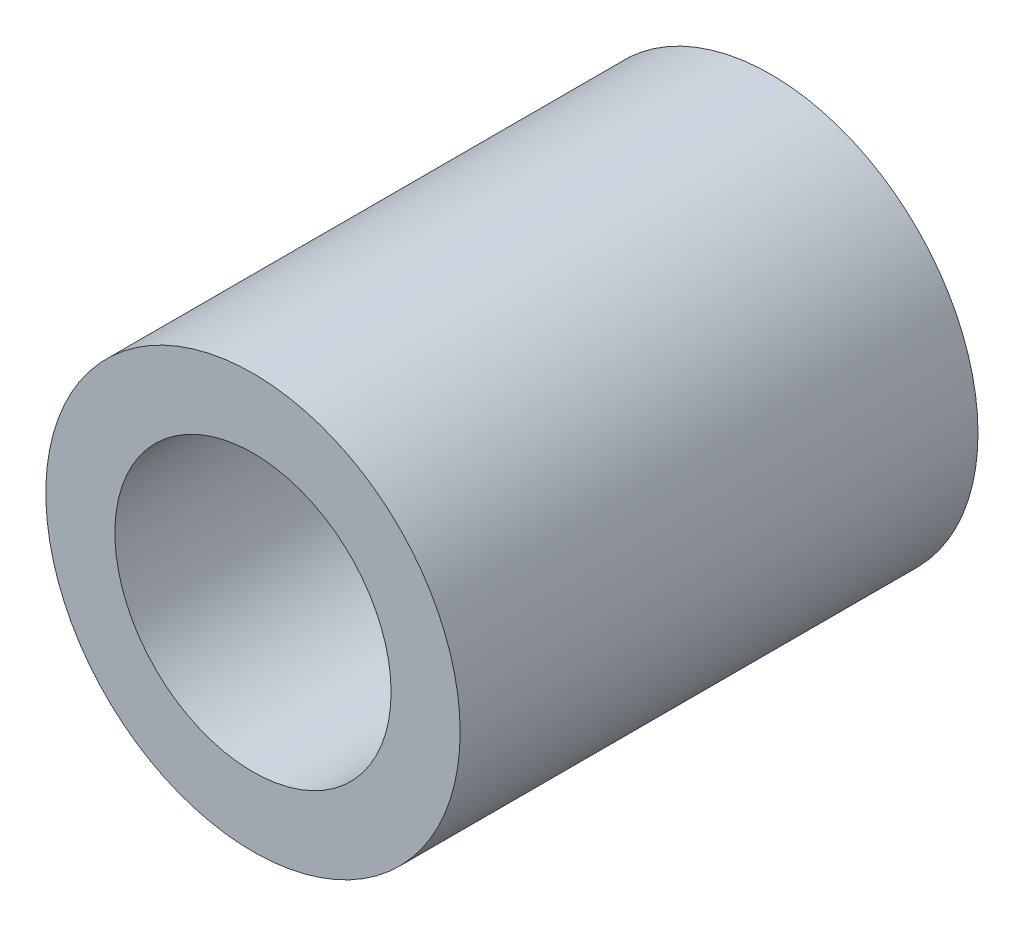
ISO-10303-21;
HEADER;
FILE_DESCRIPTION(('STEP AP214'),'2;1');
FILE_NAME('part.step','',(''),(''),'','','');
FILE_SCHEMA(('AUTOMOTIVE_DESIGN { 1 0 10303 214 1 1 1 1 }'));
ENDSEC;
DATA;
#1=APPLICATION_CONTEXT('core data for automotive mechanical design processes');
#2=APPLICATION_PROTOCOL_DEFINITION('international standard','automotive_design',2000,#1);
#3=PRODUCT_CONTEXT('',#1,'mechanical');
#4=PRODUCT('Part','Part','',(#3));
#5=PRODUCT_RELATED_PRODUCT_CATEGORY('part','',(#4));
#6=PRODUCT_DEFINITION_FORMATION('','',#4);
#7=PRODUCT_DEFINITION_CONTEXT('part definition',#1,'design');
#8=PRODUCT_DEFINITION('design','',#6,#7);
#9=PRODUCT_DEFINITION_SHAPE('','',#8);
#10=(LENGTH_UNIT() NAMED_UNIT(*) SI_UNIT(.MILLI.,.METRE.));
#11=(NAMED_UNIT(*) PLANE_ANGLE_UNIT() SI_UNIT($,.RADIAN.));
#12=(NAMED_UNIT(*) SI_UNIT($,.STERADIAN.) SOLID_ANGLE_UNIT());
#13=UNCERTAINTY_MEASURE_WITH_UNIT(LENGTH_MEASURE(1.E-05),#10,'distance_accuracy_value','');
#14=(GEOMETRIC_REPRESENTATION_CONTEXT(3) GLOBAL_UNCERTAINTY_ASSIGNED_CONTEXT((#13)) GLOBAL_UNIT_ASSIGNED_CONTEXT((#10,
#11,#12)) REPRESENTATION_CONTEXT('',''));
#15=CARTESIAN_POINT('',(0.,0.,0.));
#16=DIRECTION('',(0.,0.,1.));
#17=DIRECTION('',(1.,0.,0.));
#18=AXIS2_PLACEMENT_3D('',#15,#16,#17);
#19=CARTESIAN_POINT('',(0.,0.,6.));
#20=DIRECTION('',(0.,0.,1.));
#21=DIRECTION('',(1.,0.,0.));
#22=AXIS2_PLACEMENT_3D('',#19,#20,#21);
#23=PLANE('',#22);
#24=CARTESIAN_POINT('',(0.,0.,6.));
#25=DIRECTION('',(0.,0.,1.));
#26=DIRECTION('',(1.,0.,0.));
#27=AXIS2_PLACEMENT_3D('',#24,#25,#26);
#28=CIRCLE('',#27,2.4);
#29=CARTESIAN_POINT('',(2.4,0.,6.));
#30=VERTEX_POINT('',#29);
#31=EDGE_CURVE('E10',#30,#30,#28,.T.);
#32=ORIENTED_EDGE('',*,*,#31,.T.);
#33=EDGE_LOOP('',(#32));
#34=FACE_BOUND('',#33,.T.);
#35=CARTESIAN_POINT('',(0.,0.,6.));
#36=DIRECTION('',(0.,0.,1.));
#37=DIRECTION('',(1.,0.,0.));
#38=AXIS2_PLACEMENT_3D('',#35,#36,#37);
#39=CIRCLE('',#38,1.6);
#40=CARTESIAN_POINT('',(1.6,0.,6.));
#41=VERTEX_POINT('',#40);
#42=EDGE_CURVE('E42',#41,#41,#39,.T.);
#43=ORIENTED_EDGE('',*,*,#42,.F.);
#44=EDGE_LOOP('',(#43));
#45=FACE_BOUND('',#44,.T.);
#46=ADVANCED_FACE('F31',(#34,#45),#23,.T.);
#47=CARTESIAN_POINT('',(0.,0.,0.));
#48=DIRECTION('',(0.,0.,1.));
#49=DIRECTION('',(1.,0.,0.));
#50=AXIS2_PLACEMENT_3D('',#47,#48,#49);
#51=PLANE('',#50);
#52=CARTESIAN_POINT('',(0.,0.,0.));
#53=DIRECTION('',(0.,0.,1.));
#54=DIRECTION('',(1.,0.,0.));
#55=AXIS2_PLACEMENT_3D('',#52,#53,#54);
#56=CIRCLE('',#55,2.4);
#57=CARTESIAN_POINT('',(2.4,0.,0.));
#58=VERTEX_POINT('',#57);
#59=EDGE_CURVE('E35',#58,#58,#56,.T.);
#60=ORIENTED_EDGE('',*,*,#59,.F.);
#61=EDGE_LOOP('',(#60));
#62=FACE_BOUND('',#61,.T.);
#63=CARTESIAN_POINT('',(0.,0.,0.));
#64=DIRECTION('',(0.,0.,1.));
#65=DIRECTION('',(1.,0.,0.));
#66=AXIS2_PLACEMENT_3D('',#63,#64,#65);
#67=CIRCLE('',#66,1.6);
#68=CARTESIAN_POINT('',(1.6,0.,0.));
#69=VERTEX_POINT('',#68);
#70=EDGE_CURVE('E44',#69,#69,#67,.T.);
#71=ORIENTED_EDGE('',*,*,#70,.T.);
#72=EDGE_LOOP('',(#71));
#73=FACE_BOUND('',#72,.T.);
#74=ADVANCED_FACE('F54',(#62,#73),#51,.F.);
#75=CARTESIAN_POINT('',(0.,0.,6.));
#76=DIRECTION('',(0.,0.,-1.));
#77=DIRECTION('',(-1.,0.,0.));
#78=AXIS2_PLACEMENT_3D('',#75,#76,#77);
#79=CYLINDRICAL_SURFACE('',#78,2.4);
#80=ORIENTED_EDGE('',*,*,#31,.F.);
#81=EDGE_LOOP('',(#80));
#82=FACE_BOUND('',#81,.T.);
#83=ORIENTED_EDGE('',*,*,#59,.T.);
#84=EDGE_LOOP('',(#83));
#85=FACE_BOUND('',#84,.T.);
#86=ADVANCED_FACE('F33',(#82,#85),#79,.T.);
#87=CARTESIAN_POINT('',(0.,0.,6.));
#88=DIRECTION('',(0.,0.,-1.));
#89=DIRECTION('',(-1.,0.,0.));
#90=AXIS2_PLACEMENT_3D('',#87,#88,#89);
#91=CYLINDRICAL_SURFACE('',#90,1.6);
#92=ORIENTED_EDGE('',*,*,#42,.T.);
#93=EDGE_LOOP('',(#92));
#94=FACE_BOUND('',#93,.T.);
#95=ORIENTED_EDGE('',*,*,#70,.F.);
#96=EDGE_LOOP('',(#95));
#97=FACE_BOUND('',#96,.T.);
#98=ADVANCED_FACE('F50',(#94,#97),#91,.F.);
#99=CLOSED_SHELL('',(#46,#74,#86,#98));
#100=MANIFOLD_SOLID_BREP('B2',#99);
#101=ADVANCED_BREP_SHAPE_REPRESENTATION('',(#18,#100),#14);
#102=SHAPE_DEFINITION_REPRESENTATION(#9,#101);
ENDSEC;
END-ISO-10303-21;
